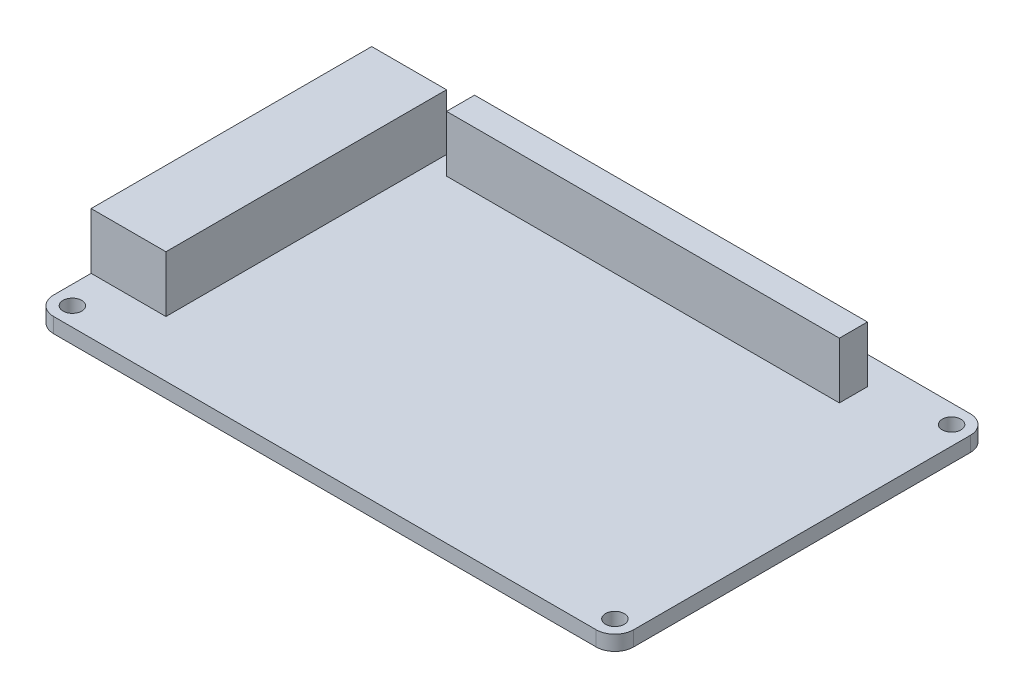
ISO-10303-21;
HEADER;
FILE_DESCRIPTION(('STEP AP214'),'2;1');
FILE_NAME('part.step','',(''),(''),'','','');
FILE_SCHEMA(('AUTOMOTIVE_DESIGN { 1 0 10303 214 1 1 1 1 }'));
ENDSEC;
DATA;
#1=APPLICATION_CONTEXT('core data for automotive mechanical design processes');
#2=APPLICATION_PROTOCOL_DEFINITION('international standard','automotive_design',2000,#1);
#3=PRODUCT_CONTEXT('',#1,'mechanical');
#4=PRODUCT('Part','Part','',(#3));
#5=PRODUCT_RELATED_PRODUCT_CATEGORY('part','',(#4));
#6=PRODUCT_DEFINITION_FORMATION('','',#4);
#7=PRODUCT_DEFINITION_CONTEXT('part definition',#1,'design');
#8=PRODUCT_DEFINITION('design','',#6,#7);
#9=PRODUCT_DEFINITION_SHAPE('','',#8);
#10=(LENGTH_UNIT() NAMED_UNIT(*) SI_UNIT(.MILLI.,.METRE.));
#11=(NAMED_UNIT(*) PLANE_ANGLE_UNIT() SI_UNIT($,.RADIAN.));
#12=(NAMED_UNIT(*) SI_UNIT($,.STERADIAN.) SOLID_ANGLE_UNIT());
#13=UNCERTAINTY_MEASURE_WITH_UNIT(LENGTH_MEASURE(1.E-05),#10,'distance_accuracy_value','');
#14=(GEOMETRIC_REPRESENTATION_CONTEXT(3) GLOBAL_UNCERTAINTY_ASSIGNED_CONTEXT((#13)) GLOBAL_UNIT_ASSIGNED_CONTEXT((#10,
#11,#12)) REPRESENTATION_CONTEXT('',''));
#15=CARTESIAN_POINT('',(0.,0.,0.));
#16=DIRECTION('',(0.,0.,1.));
#17=DIRECTION('',(1.,0.,0.));
#18=AXIS2_PLACEMENT_3D('',#15,#16,#17);
#19=CARTESIAN_POINT('',(46.0375,2.54,-28.575));
#20=DIRECTION('',(0.,-1.,0.));
#21=DIRECTION('',(0.,0.,-1.));
#22=AXIS2_PLACEMENT_3D('',#19,#20,#21);
#23=PLANE('',#22);
#24=DIRECTION('',(-1.,0.,0.));
#25=VECTOR('',#24,1.);
#26=CARTESIAN_POINT('',(-49.2125,2.54,-25.4));
#27=LINE('',#26,#25);
#28=CARTESIAN_POINT('',(-36.5125,2.54,-25.4));
#29=VERTEX_POINT('',#28);
#30=CARTESIAN_POINT('',(-49.2125,2.54,-25.4));
#31=VERTEX_POINT('',#30);
#32=EDGE_CURVE('E221',#29,#31,#27,.T.);
#33=ORIENTED_EDGE('',*,*,#32,.F.);
#34=DIRECTION('',(0.,0.,-1.));
#35=VECTOR('',#34,1.);
#36=CARTESIAN_POINT('',(-36.5125,2.54,-25.4));
#37=LINE('',#36,#35);
#38=CARTESIAN_POINT('',(-36.5125,2.54,22.225));
#39=VERTEX_POINT('',#38);
#40=EDGE_CURVE('E210',#39,#29,#37,.T.);
#41=ORIENTED_EDGE('',*,*,#40,.F.);
#42=DIRECTION('',(1.,0.,0.));
#43=VECTOR('',#42,1.);
#44=CARTESIAN_POINT('',(-49.2125,2.54,22.225));
#45=LINE('',#44,#43);
#46=CARTESIAN_POINT('',(-49.2125,2.54,22.225));
#47=VERTEX_POINT('',#46);
#48=EDGE_CURVE('E205',#47,#39,#45,.T.);
#49=ORIENTED_EDGE('',*,*,#48,.F.);
#50=DIRECTION('',(0.,0.,1.));
#51=VECTOR('',#50,1.);
#52=CARTESIAN_POINT('',(-49.2125,2.54,-28.575));
#53=LINE('',#52,#51);
#54=CARTESIAN_POINT('',(-49.2125,2.54,28.575));
#55=VERTEX_POINT('',#54);
#56=EDGE_CURVE('E290',#47,#55,#53,.T.);
#57=ORIENTED_EDGE('',*,*,#56,.T.);
#58=CARTESIAN_POINT('',(-46.0375,2.54,28.575));
#59=DIRECTION('',(0.,1.,0.));
#60=DIRECTION('',(0.,0.,1.));
#61=AXIS2_PLACEMENT_3D('',#58,#59,#60);
#62=CIRCLE('',#61,3.175);
#63=CARTESIAN_POINT('',(-46.0375,2.54,31.75));
#64=VERTEX_POINT('',#63);
#65=EDGE_CURVE('E294',#55,#64,#62,.T.);
#66=ORIENTED_EDGE('',*,*,#65,.T.);
#67=DIRECTION('',(1.,0.,0.));
#68=VECTOR('',#67,1.);
#69=CARTESIAN_POINT('',(-46.0375,2.54,31.75));
#70=LINE('',#69,#68);
#71=CARTESIAN_POINT('',(46.0375,2.54,31.75));
#72=VERTEX_POINT('',#71);
#73=EDGE_CURVE('E296',#64,#72,#70,.T.);
#74=ORIENTED_EDGE('',*,*,#73,.T.);
#75=CARTESIAN_POINT('',(46.0375,2.54,28.575));
#76=DIRECTION('',(0.,1.,0.));
#77=DIRECTION('',(0.,0.,1.));
#78=AXIS2_PLACEMENT_3D('',#75,#76,#77);
#79=CIRCLE('',#78,3.175);
#80=CARTESIAN_POINT('',(49.2125,2.54,28.575));
#81=VERTEX_POINT('',#80);
#82=EDGE_CURVE('E299',#72,#81,#79,.T.);
#83=ORIENTED_EDGE('',*,*,#82,.T.);
#84=DIRECTION('',(0.,0.,-1.));
#85=VECTOR('',#84,1.);
#86=CARTESIAN_POINT('',(49.2125,2.54,-28.575));
#87=LINE('',#86,#85);
#88=CARTESIAN_POINT('',(49.2125,2.54,-28.575));
#89=VERTEX_POINT('',#88);
#90=EDGE_CURVE('E302',#81,#89,#87,.T.);
#91=ORIENTED_EDGE('',*,*,#90,.T.);
#92=CARTESIAN_POINT('',(46.0375,2.54,-28.575));
#93=DIRECTION('',(0.,1.,0.));
#94=DIRECTION('',(0.,0.,-1.));
#95=AXIS2_PLACEMENT_3D('',#92,#93,#94);
#96=CIRCLE('',#95,3.175);
#97=CARTESIAN_POINT('',(46.0375,2.54,-31.75));
#98=VERTEX_POINT('',#97);
#99=EDGE_CURVE('E279',#89,#98,#96,.T.);
#100=ORIENTED_EDGE('',*,*,#99,.T.);
#101=DIRECTION('',(-1.,0.,0.));
#102=VECTOR('',#101,1.);
#103=CARTESIAN_POINT('',(-46.0375,2.54,-31.75));
#104=LINE('',#103,#102);
#105=CARTESIAN_POINT('',(-46.0375,2.54,-31.75));
#106=VERTEX_POINT('',#105);
#107=EDGE_CURVE('E283',#98,#106,#104,.T.);
#108=ORIENTED_EDGE('',*,*,#107,.T.);
#109=CARTESIAN_POINT('',(-46.0375,2.54,-28.575));
#110=DIRECTION('',(0.,1.,0.));
#111=DIRECTION('',(0.,0.,1.));
#112=AXIS2_PLACEMENT_3D('',#109,#110,#111);
#113=CIRCLE('',#112,3.175);
#114=CARTESIAN_POINT('',(-49.2125,2.54,-28.575));
#115=VERTEX_POINT('',#114);
#116=EDGE_CURVE('E287',#106,#115,#113,.T.);
#117=ORIENTED_EDGE('',*,*,#116,.T.);
#118=EDGE_CURVE('E291',#115,#31,#53,.T.);
#119=ORIENTED_EDGE('',*,*,#118,.T.);
#120=EDGE_LOOP('',(#33,#41,#49,#57,#66,#74,#83,#91,#100,#108,#117,#119));
#121=FACE_BOUND('',#120,.T.);
#122=CARTESIAN_POINT('',(-46.0375,2.54,-28.575));
#123=DIRECTION('',(0.,1.,0.));
#124=DIRECTION('',(0.,0.,1.));
#125=AXIS2_PLACEMENT_3D('',#122,#123,#124);
#126=CIRCLE('',#125,1.5875);
#127=CARTESIAN_POINT('',(-46.0375,2.54,-26.9875));
#128=VERTEX_POINT('',#127);
#129=EDGE_CURVE('E271',#128,#128,#126,.T.);
#130=ORIENTED_EDGE('',*,*,#129,.F.);
#131=EDGE_LOOP('',(#130));
#132=FACE_BOUND('',#131,.T.);
#133=CARTESIAN_POINT('',(46.0375,2.54,-28.575));
#134=DIRECTION('',(0.,1.,0.));
#135=DIRECTION('',(0.,0.,-1.));
#136=AXIS2_PLACEMENT_3D('',#133,#134,#135);
#137=CIRCLE('',#136,1.58750000000001);
#138=CARTESIAN_POINT('',(46.0375,2.54,-30.1625));
#139=VERTEX_POINT('',#138);
#140=EDGE_CURVE('E264',#139,#139,#137,.T.);
#141=ORIENTED_EDGE('',*,*,#140,.F.);
#142=EDGE_LOOP('',(#141));
#143=FACE_BOUND('',#142,.T.);
#144=CARTESIAN_POINT('',(46.0375,2.54,28.575));
#145=DIRECTION('',(0.,1.,0.));
#146=DIRECTION('',(0.,0.,1.));
#147=AXIS2_PLACEMENT_3D('',#144,#145,#146);
#148=CIRCLE('',#147,1.58750000000001);
#149=CARTESIAN_POINT('',(46.0375,2.54,30.1625));
#150=VERTEX_POINT('',#149);
#151=EDGE_CURVE('E256',#150,#150,#148,.T.);
#152=ORIENTED_EDGE('',*,*,#151,.F.);
#153=EDGE_LOOP('',(#152));
#154=FACE_BOUND('',#153,.T.);
#155=CARTESIAN_POINT('',(-46.0375,2.54,28.575));
#156=DIRECTION('',(0.,1.,0.));
#157=DIRECTION('',(0.,0.,-1.));
#158=AXIS2_PLACEMENT_3D('',#155,#156,#157);
#159=CIRCLE('',#158,1.58749999999999);
#160=CARTESIAN_POINT('',(-46.0375,2.54,26.9875));
#161=VERTEX_POINT('',#160);
#162=EDGE_CURVE('E250',#161,#161,#159,.T.);
#163=ORIENTED_EDGE('',*,*,#162,.F.);
#164=EDGE_LOOP('',(#163));
#165=FACE_BOUND('',#164,.T.);
#166=DIRECTION('',(0.,0.,-1.));
#167=VECTOR('',#166,1.);
#168=CARTESIAN_POINT('',(33.3375,2.54,-26.9875));
#169=LINE('',#168,#167);
#170=CARTESIAN_POINT('',(33.3375,2.54,-22.225));
#171=VERTEX_POINT('',#170);
#172=CARTESIAN_POINT('',(33.3375,2.54,-26.9875));
#173=VERTEX_POINT('',#172);
#174=EDGE_CURVE('E203',#171,#173,#169,.T.);
#175=ORIENTED_EDGE('',*,*,#174,.F.);
#176=DIRECTION('',(1.,0.,0.));
#177=VECTOR('',#176,1.);
#178=CARTESIAN_POINT('',(33.3375,2.54,-22.225));
#179=LINE('',#178,#177);
#180=CARTESIAN_POINT('',(-33.3375,2.54,-22.225));
#181=VERTEX_POINT('',#180);
#182=EDGE_CURVE('E200',#181,#171,#179,.T.);
#183=ORIENTED_EDGE('',*,*,#182,.F.);
#184=DIRECTION('',(0.,0.,1.));
#185=VECTOR('',#184,1.);
#186=CARTESIAN_POINT('',(-33.3375,2.54,-26.9875));
#187=LINE('',#186,#185);
#188=CARTESIAN_POINT('',(-33.3375,2.54,-26.9875));
#189=VERTEX_POINT('',#188);
#190=EDGE_CURVE('E74',#189,#181,#187,.T.);
#191=ORIENTED_EDGE('',*,*,#190,.F.);
#192=DIRECTION('',(-1.,0.,0.));
#193=VECTOR('',#192,1.);
#194=CARTESIAN_POINT('',(33.3375,2.54,-26.9875));
#195=LINE('',#194,#193);
#196=EDGE_CURVE('E69',#173,#189,#195,.T.);
#197=ORIENTED_EDGE('',*,*,#196,.F.);
#198=EDGE_LOOP('',(#175,#183,#191,#197));
#199=FACE_BOUND('',#198,.T.);
#200=ADVANCED_FACE('F50',(#121,#132,#143,#154,#165,#199),#23,.F.);
#201=CARTESIAN_POINT('',(46.0375,0.,-28.575));
#202=DIRECTION('',(0.,-1.,0.));
#203=DIRECTION('',(0.,0.,-1.));
#204=AXIS2_PLACEMENT_3D('',#201,#202,#203);
#205=PLANE('',#204);
#206=CARTESIAN_POINT('',(46.0375,0.,28.575));
#207=DIRECTION('',(0.,1.,0.));
#208=DIRECTION('',(0.,0.,1.));
#209=AXIS2_PLACEMENT_3D('',#206,#207,#208);
#210=CIRCLE('',#209,1.58750000000001);
#211=CARTESIAN_POINT('',(46.0375,0.,30.1625));
#212=VERTEX_POINT('',#211);
#213=EDGE_CURVE('E253',#212,#212,#210,.T.);
#214=ORIENTED_EDGE('',*,*,#213,.T.);
#215=EDGE_LOOP('',(#214));
#216=FACE_BOUND('',#215,.T.);
#217=CARTESIAN_POINT('',(-46.0375,0.,-28.575));
#218=DIRECTION('',(0.,1.,0.));
#219=DIRECTION('',(0.,0.,1.));
#220=AXIS2_PLACEMENT_3D('',#217,#218,#219);
#221=CIRCLE('',#220,1.5875);
#222=CARTESIAN_POINT('',(-46.0375,0.,-26.9875));
#223=VERTEX_POINT('',#222);
#224=EDGE_CURVE('E268',#223,#223,#221,.T.);
#225=ORIENTED_EDGE('',*,*,#224,.T.);
#226=EDGE_LOOP('',(#225));
#227=FACE_BOUND('',#226,.T.);
#228=CARTESIAN_POINT('',(46.0375,0.,-28.575));
#229=DIRECTION('',(0.,1.,0.));
#230=DIRECTION('',(0.,0.,-1.));
#231=AXIS2_PLACEMENT_3D('',#228,#229,#230);
#232=CIRCLE('',#231,3.175);
#233=CARTESIAN_POINT('',(49.2125,0.,-28.575));
#234=VERTEX_POINT('',#233);
#235=CARTESIAN_POINT('',(46.0375,0.,-31.75));
#236=VERTEX_POINT('',#235);
#237=EDGE_CURVE('E275',#234,#236,#232,.T.);
#238=ORIENTED_EDGE('',*,*,#237,.F.);
#239=DIRECTION('',(0.,0.,-1.));
#240=VECTOR('',#239,1.);
#241=CARTESIAN_POINT('',(49.2125,0.,-28.575));
#242=LINE('',#241,#240);
#243=CARTESIAN_POINT('',(49.2125,0.,28.575));
#244=VERTEX_POINT('',#243);
#245=EDGE_CURVE('E284',#244,#234,#242,.T.);
#246=ORIENTED_EDGE('',*,*,#245,.F.);
#247=CARTESIAN_POINT('',(46.0375,0.,28.575));
#248=DIRECTION('',(0.,1.,0.));
#249=DIRECTION('',(0.,0.,1.));
#250=AXIS2_PLACEMENT_3D('',#247,#248,#249);
#251=CIRCLE('',#250,3.175);
#252=CARTESIAN_POINT('',(46.0375,0.,31.75));
#253=VERTEX_POINT('',#252);
#254=EDGE_CURVE('E322',#253,#244,#251,.T.);
#255=ORIENTED_EDGE('',*,*,#254,.F.);
#256=DIRECTION('',(1.,0.,0.));
#257=VECTOR('',#256,1.);
#258=CARTESIAN_POINT('',(-46.0375,0.,31.75));
#259=LINE('',#258,#257);
#260=CARTESIAN_POINT('',(-46.0375,0.,31.75));
#261=VERTEX_POINT('',#260);
#262=EDGE_CURVE('E319',#261,#253,#259,.T.);
#263=ORIENTED_EDGE('',*,*,#262,.F.);
#264=CARTESIAN_POINT('',(-46.0375,0.,28.575));
#265=DIRECTION('',(0.,1.,0.));
#266=DIRECTION('',(0.,0.,1.));
#267=AXIS2_PLACEMENT_3D('',#264,#265,#266);
#268=CIRCLE('',#267,3.175);
#269=CARTESIAN_POINT('',(-49.2125,0.,28.575));
#270=VERTEX_POINT('',#269);
#271=EDGE_CURVE('E317',#270,#261,#268,.T.);
#272=ORIENTED_EDGE('',*,*,#271,.F.);
#273=DIRECTION('',(0.,0.,1.));
#274=VECTOR('',#273,1.);
#275=CARTESIAN_POINT('',(-49.2125,0.,-28.575));
#276=LINE('',#275,#274);
#277=CARTESIAN_POINT('',(-49.2125,0.,-28.575));
#278=VERTEX_POINT('',#277);
#279=EDGE_CURVE('E314',#278,#270,#276,.T.);
#280=ORIENTED_EDGE('',*,*,#279,.F.);
#281=CARTESIAN_POINT('',(-46.0375,0.,-28.575));
#282=DIRECTION('',(0.,1.,0.));
#283=DIRECTION('',(0.,0.,1.));
#284=AXIS2_PLACEMENT_3D('',#281,#282,#283);
#285=CIRCLE('',#284,3.175);
#286=CARTESIAN_POINT('',(-46.0375,0.,-31.75));
#287=VERTEX_POINT('',#286);
#288=EDGE_CURVE('E311',#287,#278,#285,.T.);
#289=ORIENTED_EDGE('',*,*,#288,.F.);
#290=DIRECTION('',(-1.,0.,0.));
#291=VECTOR('',#290,1.);
#292=CARTESIAN_POINT('',(-46.0375,0.,-31.75));
#293=LINE('',#292,#291);
#294=EDGE_CURVE('E308',#236,#287,#293,.T.);
#295=ORIENTED_EDGE('',*,*,#294,.F.);
#296=EDGE_LOOP('',(#238,#246,#255,#263,#272,#280,#289,#295));
#297=FACE_BOUND('',#296,.T.);
#298=CARTESIAN_POINT('',(46.0375,0.,-28.575));
#299=DIRECTION('',(0.,1.,0.));
#300=DIRECTION('',(0.,0.,-1.));
#301=AXIS2_PLACEMENT_3D('',#298,#299,#300);
#302=CIRCLE('',#301,1.58750000000001);
#303=CARTESIAN_POINT('',(46.0375,0.,-30.1625));
#304=VERTEX_POINT('',#303);
#305=EDGE_CURVE('E260',#304,#304,#302,.T.);
#306=ORIENTED_EDGE('',*,*,#305,.T.);
#307=EDGE_LOOP('',(#306));
#308=FACE_BOUND('',#307,.T.);
#309=CARTESIAN_POINT('',(-46.0375,0.,28.575));
#310=DIRECTION('',(0.,1.,0.));
#311=DIRECTION('',(0.,0.,-1.));
#312=AXIS2_PLACEMENT_3D('',#309,#310,#311);
#313=CIRCLE('',#312,1.58749999999999);
#314=CARTESIAN_POINT('',(-46.0375,0.,26.9875));
#315=VERTEX_POINT('',#314);
#316=EDGE_CURVE('E249',#315,#315,#313,.T.);
#317=ORIENTED_EDGE('',*,*,#316,.T.);
#318=EDGE_LOOP('',(#317));
#319=FACE_BOUND('',#318,.T.);
#320=ADVANCED_FACE('F359',(#216,#227,#297,#308,#319),#205,.T.);
#321=CARTESIAN_POINT('',(46.0375,2.54,-28.575));
#322=DIRECTION('',(0.,-1.,0.));
#323=DIRECTION('',(0.,0.,-1.));
#324=AXIS2_PLACEMENT_3D('',#321,#322,#323);
#325=CYLINDRICAL_SURFACE('',#324,3.175);
#326=ORIENTED_EDGE('',*,*,#237,.T.);
#327=DIRECTION('',(0.,-1.,0.));
#328=VECTOR('',#327,1.);
#329=CARTESIAN_POINT('',(46.0375,2.54,-31.75));
#330=LINE('',#329,#328);
#331=EDGE_CURVE('E13',#98,#236,#330,.T.);
#332=ORIENTED_EDGE('',*,*,#331,.F.);
#333=ORIENTED_EDGE('',*,*,#99,.F.);
#334=DIRECTION('',(0.,-1.,0.));
#335=VECTOR('',#334,1.);
#336=CARTESIAN_POINT('',(49.2125,2.54,-28.575));
#337=LINE('',#336,#335);
#338=EDGE_CURVE('E305',#89,#234,#337,.T.);
#339=ORIENTED_EDGE('',*,*,#338,.T.);
#340=EDGE_LOOP('',(#326,#332,#333,#339));
#341=FACE_BOUND('',#340,.T.);
#342=ADVANCED_FACE('F52',(#341),#325,.T.);
#343=CARTESIAN_POINT('',(-46.0375,2.54,-31.75));
#344=DIRECTION('',(0.,0.,1.));
#345=DIRECTION('',(1.,0.,0.));
#346=AXIS2_PLACEMENT_3D('',#343,#344,#345);
#347=PLANE('',#346);
#348=ORIENTED_EDGE('',*,*,#294,.T.);
#349=DIRECTION('',(0.,-1.,0.));
#350=VECTOR('',#349,1.);
#351=CARTESIAN_POINT('',(-46.0375,2.54,-31.75));
#352=LINE('',#351,#350);
#353=EDGE_CURVE('E59',#106,#287,#352,.T.);
#354=ORIENTED_EDGE('',*,*,#353,.F.);
#355=ORIENTED_EDGE('',*,*,#107,.F.);
#356=ORIENTED_EDGE('',*,*,#331,.T.);
#357=EDGE_LOOP('',(#348,#354,#355,#356));
#358=FACE_BOUND('',#357,.T.);
#359=ADVANCED_FACE('F428',(#358),#347,.F.);
#360=CARTESIAN_POINT('',(-46.0375,2.54,-28.575));
#361=DIRECTION('',(0.,-1.,0.));
#362=DIRECTION('',(0.,0.,-1.));
#363=AXIS2_PLACEMENT_3D('',#360,#361,#362);
#364=CYLINDRICAL_SURFACE('',#363,3.175);
#365=ORIENTED_EDGE('',*,*,#288,.T.);
#366=DIRECTION('',(0.,-1.,0.));
#367=VECTOR('',#366,1.);
#368=CARTESIAN_POINT('',(-49.2125,2.54,-28.575));
#369=LINE('',#368,#367);
#370=EDGE_CURVE('E344',#115,#278,#369,.T.);
#371=ORIENTED_EDGE('',*,*,#370,.F.);
#372=ORIENTED_EDGE('',*,*,#116,.F.);
#373=ORIENTED_EDGE('',*,*,#353,.T.);
#374=EDGE_LOOP('',(#365,#371,#372,#373));
#375=FACE_BOUND('',#374,.T.);
#376=ADVANCED_FACE('F353',(#375),#364,.T.);
#377=CARTESIAN_POINT('',(-49.2125,2.54,-28.575));
#378=DIRECTION('',(1.,0.,0.));
#379=DIRECTION('',(0.,0.,-1.));
#380=AXIS2_PLACEMENT_3D('',#377,#378,#379);
#381=PLANE('',#380);
#382=ORIENTED_EDGE('',*,*,#279,.T.);
#383=DIRECTION('',(0.,-1.,0.));
#384=VECTOR('',#383,1.);
#385=CARTESIAN_POINT('',(-49.2125,2.54,28.575));
#386=LINE('',#385,#384);
#387=EDGE_CURVE('E341',#55,#270,#386,.T.);
#388=ORIENTED_EDGE('',*,*,#387,.F.);
#389=ORIENTED_EDGE('',*,*,#56,.F.);
#390=DIRECTION('',(0.,-1.,0.));
#391=VECTOR('',#390,1.);
#392=CARTESIAN_POINT('',(-49.2125,12.065,22.225));
#393=LINE('',#392,#391);
#394=CARTESIAN_POINT('',(-49.2125,12.065,22.225));
#395=VERTEX_POINT('',#394);
#396=EDGE_CURVE('E246',#395,#47,#393,.T.);
#397=ORIENTED_EDGE('',*,*,#396,.F.);
#398=DIRECTION('',(0.,0.,1.));
#399=VECTOR('',#398,1.);
#400=CARTESIAN_POINT('',(-49.2125,12.065,-25.4));
#401=LINE('',#400,#399);
#402=CARTESIAN_POINT('',(-49.2125,12.065,-25.4));
#403=VERTEX_POINT('',#402);
#404=EDGE_CURVE('E216',#403,#395,#401,.T.);
#405=ORIENTED_EDGE('',*,*,#404,.F.);
#406=DIRECTION('',(0.,-1.,0.));
#407=VECTOR('',#406,1.);
#408=CARTESIAN_POINT('',(-49.2125,12.065,-25.4));
#409=LINE('',#408,#407);
#410=EDGE_CURVE('E229',#403,#31,#409,.T.);
#411=ORIENTED_EDGE('',*,*,#410,.T.);
#412=ORIENTED_EDGE('',*,*,#118,.F.);
#413=ORIENTED_EDGE('',*,*,#370,.T.);
#414=EDGE_LOOP('',(#382,#388,#389,#397,#405,#411,#412,#413));
#415=FACE_BOUND('',#414,.T.);
#416=ADVANCED_FACE('F365',(#415),#381,.F.);
#417=CARTESIAN_POINT('',(-46.0375,2.54,28.575));
#418=DIRECTION('',(0.,-1.,0.));
#419=DIRECTION('',(0.,0.,-1.));
#420=AXIS2_PLACEMENT_3D('',#417,#418,#419);
#421=CYLINDRICAL_SURFACE('',#420,3.175);
#422=ORIENTED_EDGE('',*,*,#271,.T.);
#423=DIRECTION('',(0.,-1.,0.));
#424=VECTOR('',#423,1.);
#425=CARTESIAN_POINT('',(-46.0375,2.54,31.75));
#426=LINE('',#425,#424);
#427=EDGE_CURVE('E338',#64,#261,#426,.T.);
#428=ORIENTED_EDGE('',*,*,#427,.F.);
#429=ORIENTED_EDGE('',*,*,#65,.F.);
#430=ORIENTED_EDGE('',*,*,#387,.T.);
#431=EDGE_LOOP('',(#422,#428,#429,#430));
#432=FACE_BOUND('',#431,.T.);
#433=ADVANCED_FACE('F370',(#432),#421,.T.);
#434=CARTESIAN_POINT('',(-46.0375,2.54,31.75));
#435=DIRECTION('',(0.,0.,-1.));
#436=DIRECTION('',(-1.,0.,0.));
#437=AXIS2_PLACEMENT_3D('',#434,#435,#436);
#438=PLANE('',#437);
#439=ORIENTED_EDGE('',*,*,#262,.T.);
#440=DIRECTION('',(0.,-1.,0.));
#441=VECTOR('',#440,1.);
#442=CARTESIAN_POINT('',(46.0375,2.54,31.75));
#443=LINE('',#442,#441);
#444=EDGE_CURVE('E334',#72,#253,#443,.T.);
#445=ORIENTED_EDGE('',*,*,#444,.F.);
#446=ORIENTED_EDGE('',*,*,#73,.F.);
#447=ORIENTED_EDGE('',*,*,#427,.T.);
#448=EDGE_LOOP('',(#439,#445,#446,#447));
#449=FACE_BOUND('',#448,.T.);
#450=ADVANCED_FACE('F418',(#449),#438,.F.);
#451=CARTESIAN_POINT('',(46.0375,2.54,28.575));
#452=DIRECTION('',(0.,-1.,0.));
#453=DIRECTION('',(0.,0.,-1.));
#454=AXIS2_PLACEMENT_3D('',#451,#452,#453);
#455=CYLINDRICAL_SURFACE('',#454,3.175);
#456=ORIENTED_EDGE('',*,*,#254,.T.);
#457=DIRECTION('',(0.,-1.,0.));
#458=VECTOR('',#457,1.);
#459=CARTESIAN_POINT('',(49.2125,2.54,28.575));
#460=LINE('',#459,#458);
#461=EDGE_CURVE('E330',#81,#244,#460,.T.);
#462=ORIENTED_EDGE('',*,*,#461,.F.);
#463=ORIENTED_EDGE('',*,*,#82,.F.);
#464=ORIENTED_EDGE('',*,*,#444,.T.);
#465=EDGE_LOOP('',(#456,#462,#463,#464));
#466=FACE_BOUND('',#465,.T.);
#467=ADVANCED_FACE('F414',(#466),#455,.T.);
#468=CARTESIAN_POINT('',(49.2125,2.54,-28.575));
#469=DIRECTION('',(-1.,0.,0.));
#470=DIRECTION('',(0.,0.,1.));
#471=AXIS2_PLACEMENT_3D('',#468,#469,#470);
#472=PLANE('',#471);
#473=ORIENTED_EDGE('',*,*,#245,.T.);
#474=ORIENTED_EDGE('',*,*,#338,.F.);
#475=ORIENTED_EDGE('',*,*,#90,.F.);
#476=ORIENTED_EDGE('',*,*,#461,.T.);
#477=EDGE_LOOP('',(#473,#474,#475,#476));
#478=FACE_BOUND('',#477,.T.);
#479=ADVANCED_FACE('F411',(#478),#472,.F.);
#480=CARTESIAN_POINT('',(-46.0375,2.54,-28.575));
#481=DIRECTION('',(0.,-1.,0.));
#482=DIRECTION('',(0.,0.,-1.));
#483=AXIS2_PLACEMENT_3D('',#480,#481,#482);
#484=CYLINDRICAL_SURFACE('',#483,1.5875);
#485=ORIENTED_EDGE('',*,*,#129,.T.);
#486=EDGE_LOOP('',(#485));
#487=FACE_BOUND('',#486,.T.);
#488=ORIENTED_EDGE('',*,*,#224,.F.);
#489=EDGE_LOOP('',(#488));
#490=FACE_BOUND('',#489,.T.);
#491=ADVANCED_FACE('F408',(#487,#490),#484,.F.);
#492=CARTESIAN_POINT('',(46.0375,2.54,-28.575));
#493=DIRECTION('',(0.,-1.,0.));
#494=DIRECTION('',(0.,0.,-1.));
#495=AXIS2_PLACEMENT_3D('',#492,#493,#494);
#496=CYLINDRICAL_SURFACE('',#495,1.58750000000001);
#497=ORIENTED_EDGE('',*,*,#140,.T.);
#498=EDGE_LOOP('',(#497));
#499=FACE_BOUND('',#498,.T.);
#500=ORIENTED_EDGE('',*,*,#305,.F.);
#501=EDGE_LOOP('',(#500));
#502=FACE_BOUND('',#501,.T.);
#503=ADVANCED_FACE('F465',(#499,#502),#496,.F.);
#504=CARTESIAN_POINT('',(46.0375,2.54,28.575));
#505=DIRECTION('',(0.,-1.,0.));
#506=DIRECTION('',(0.,0.,-1.));
#507=AXIS2_PLACEMENT_3D('',#504,#505,#506);
#508=CYLINDRICAL_SURFACE('',#507,1.58750000000001);
#509=ORIENTED_EDGE('',*,*,#151,.T.);
#510=EDGE_LOOP('',(#509));
#511=FACE_BOUND('',#510,.T.);
#512=ORIENTED_EDGE('',*,*,#213,.F.);
#513=EDGE_LOOP('',(#512));
#514=FACE_BOUND('',#513,.T.);
#515=ADVANCED_FACE('F529',(#511,#514),#508,.F.);
#516=CARTESIAN_POINT('',(-46.0375,2.54,28.575));
#517=DIRECTION('',(0.,-1.,0.));
#518=DIRECTION('',(0.,0.,-1.));
#519=AXIS2_PLACEMENT_3D('',#516,#517,#518);
#520=CYLINDRICAL_SURFACE('',#519,1.58749999999999);
#521=ORIENTED_EDGE('',*,*,#162,.T.);
#522=EDGE_LOOP('',(#521));
#523=FACE_BOUND('',#522,.T.);
#524=ORIENTED_EDGE('',*,*,#316,.F.);
#525=EDGE_LOOP('',(#524));
#526=FACE_BOUND('',#525,.T.);
#527=ADVANCED_FACE('F398',(#523,#526),#520,.F.);
#528=CARTESIAN_POINT('',(-49.2125,12.065,22.225));
#529=DIRECTION('',(0.,0.,-1.));
#530=DIRECTION('',(-1.,0.,0.));
#531=AXIS2_PLACEMENT_3D('',#528,#529,#530);
#532=PLANE('',#531);
#533=ORIENTED_EDGE('',*,*,#48,.T.);
#534=DIRECTION('',(0.,-1.,0.));
#535=VECTOR('',#534,1.);
#536=CARTESIAN_POINT('',(-36.5125,12.065,22.225));
#537=LINE('',#536,#535);
#538=CARTESIAN_POINT('',(-36.5125,12.065,22.225));
#539=VERTEX_POINT('',#538);
#540=EDGE_CURVE('E242',#539,#39,#537,.T.);
#541=ORIENTED_EDGE('',*,*,#540,.F.);
#542=DIRECTION('',(1.,0.,0.));
#543=VECTOR('',#542,1.);
#544=CARTESIAN_POINT('',(-49.2125,12.065,22.225));
#545=LINE('',#544,#543);
#546=EDGE_CURVE('E220',#395,#539,#545,.T.);
#547=ORIENTED_EDGE('',*,*,#546,.F.);
#548=ORIENTED_EDGE('',*,*,#396,.T.);
#549=EDGE_LOOP('',(#533,#541,#547,#548));
#550=FACE_BOUND('',#549,.T.);
#551=ADVANCED_FACE('F379',(#550),#532,.F.);
#552=CARTESIAN_POINT('',(-36.5125,12.065,-25.4));
#553=DIRECTION('',(-1.,0.,0.));
#554=DIRECTION('',(0.,0.,1.));
#555=AXIS2_PLACEMENT_3D('',#552,#553,#554);
#556=PLANE('',#555);
#557=ORIENTED_EDGE('',*,*,#40,.T.);
#558=DIRECTION('',(0.,-1.,0.));
#559=VECTOR('',#558,1.);
#560=CARTESIAN_POINT('',(-36.5125,12.065,-25.4));
#561=LINE('',#560,#559);
#562=CARTESIAN_POINT('',(-36.5125,12.065,-25.4));
#563=VERTEX_POINT('',#562);
#564=EDGE_CURVE('E239',#563,#29,#561,.T.);
#565=ORIENTED_EDGE('',*,*,#564,.F.);
#566=DIRECTION('',(0.,0.,-1.));
#567=VECTOR('',#566,1.);
#568=CARTESIAN_POINT('',(-36.5125,12.065,-25.4));
#569=LINE('',#568,#567);
#570=EDGE_CURVE('E224',#539,#563,#569,.T.);
#571=ORIENTED_EDGE('',*,*,#570,.F.);
#572=ORIENTED_EDGE('',*,*,#540,.T.);
#573=EDGE_LOOP('',(#557,#565,#571,#572));
#574=FACE_BOUND('',#573,.T.);
#575=ADVANCED_FACE('F390',(#574),#556,.F.);
#576=CARTESIAN_POINT('',(-49.2125,12.065,-25.4));
#577=DIRECTION('',(0.,0.,1.));
#578=DIRECTION('',(1.,0.,0.));
#579=AXIS2_PLACEMENT_3D('',#576,#577,#578);
#580=PLANE('',#579);
#581=ORIENTED_EDGE('',*,*,#32,.T.);
#582=ORIENTED_EDGE('',*,*,#410,.F.);
#583=DIRECTION('',(-1.,0.,0.));
#584=VECTOR('',#583,1.);
#585=CARTESIAN_POINT('',(-49.2125,12.065,-25.4));
#586=LINE('',#585,#584);
#587=EDGE_CURVE('E227',#563,#403,#586,.T.);
#588=ORIENTED_EDGE('',*,*,#587,.F.);
#589=ORIENTED_EDGE('',*,*,#564,.T.);
#590=EDGE_LOOP('',(#581,#582,#588,#589));
#591=FACE_BOUND('',#590,.T.);
#592=ADVANCED_FACE('F387',(#591),#580,.F.);
#593=CARTESIAN_POINT('',(0.,12.065,0.));
#594=DIRECTION('',(0.,1.,0.));
#595=DIRECTION('',(0.,0.,1.));
#596=AXIS2_PLACEMENT_3D('',#593,#594,#595);
#597=PLANE('',#596);
#598=ORIENTED_EDGE('',*,*,#404,.T.);
#599=ORIENTED_EDGE('',*,*,#546,.T.);
#600=ORIENTED_EDGE('',*,*,#570,.T.);
#601=ORIENTED_EDGE('',*,*,#587,.T.);
#602=EDGE_LOOP('',(#598,#599,#600,#601));
#603=FACE_BOUND('',#602,.T.);
#604=ADVANCED_FACE('F383',(#603),#597,.T.);
#605=CARTESIAN_POINT('',(33.3375,12.065,-26.9875));
#606=DIRECTION('',(-1.,0.,0.));
#607=DIRECTION('',(0.,0.,1.));
#608=AXIS2_PLACEMENT_3D('',#605,#606,#607);
#609=PLANE('',#608);
#610=ORIENTED_EDGE('',*,*,#174,.T.);
#611=DIRECTION('',(0.,-1.,0.));
#612=VECTOR('',#611,1.);
#613=CARTESIAN_POINT('',(33.3375,12.065,-26.9875));
#614=LINE('',#613,#612);
#615=CARTESIAN_POINT('',(33.3375,12.065,-26.9875));
#616=VERTEX_POINT('',#615);
#617=EDGE_CURVE('E182',#616,#173,#614,.T.);
#618=ORIENTED_EDGE('',*,*,#617,.F.);
#619=DIRECTION('',(0.,0.,-1.));
#620=VECTOR('',#619,1.);
#621=CARTESIAN_POINT('',(33.3375,12.065,-26.9875));
#622=LINE('',#621,#620);
#623=CARTESIAN_POINT('',(33.3375,12.065,-22.225));
#624=VERTEX_POINT('',#623);
#625=EDGE_CURVE('E190',#624,#616,#622,.T.);
#626=ORIENTED_EDGE('',*,*,#625,.F.);
#627=DIRECTION('',(0.,-1.,0.));
#628=VECTOR('',#627,1.);
#629=CARTESIAN_POINT('',(33.3375,12.065,-22.225));
#630=LINE('',#629,#628);
#631=EDGE_CURVE('E611',#624,#171,#630,.T.);
#632=ORIENTED_EDGE('',*,*,#631,.T.);
#633=EDGE_LOOP('',(#610,#618,#626,#632));
#634=FACE_BOUND('',#633,.T.);
#635=ADVANCED_FACE('F202',(#634),#609,.F.);
#636=CARTESIAN_POINT('',(33.3375,12.065,-26.9875));
#637=DIRECTION('',(0.,0.,1.));
#638=DIRECTION('',(1.,0.,0.));
#639=AXIS2_PLACEMENT_3D('',#636,#637,#638);
#640=PLANE('',#639);
#641=ORIENTED_EDGE('',*,*,#196,.T.);
#642=DIRECTION('',(0.,-1.,0.));
#643=VECTOR('',#642,1.);
#644=CARTESIAN_POINT('',(-33.3375,12.065,-26.9875));
#645=LINE('',#644,#643);
#646=CARTESIAN_POINT('',(-33.3375,12.065,-26.9875));
#647=VERTEX_POINT('',#646);
#648=EDGE_CURVE('E185',#647,#189,#645,.T.);
#649=ORIENTED_EDGE('',*,*,#648,.F.);
#650=DIRECTION('',(-1.,0.,0.));
#651=VECTOR('',#650,1.);
#652=CARTESIAN_POINT('',(33.3375,12.065,-26.9875));
#653=LINE('',#652,#651);
#654=EDGE_CURVE('E178',#616,#647,#653,.T.);
#655=ORIENTED_EDGE('',*,*,#654,.F.);
#656=ORIENTED_EDGE('',*,*,#617,.T.);
#657=EDGE_LOOP('',(#641,#649,#655,#656));
#658=FACE_BOUND('',#657,.T.);
#659=ADVANCED_FACE('F180',(#658),#640,.F.);
#660=CARTESIAN_POINT('',(-33.3375,12.065,-26.9875));
#661=DIRECTION('',(1.,0.,0.));
#662=DIRECTION('',(0.,0.,-1.));
#663=AXIS2_PLACEMENT_3D('',#660,#661,#662);
#664=PLANE('',#663);
#665=ORIENTED_EDGE('',*,*,#190,.T.);
#666=DIRECTION('',(0.,-1.,0.));
#667=VECTOR('',#666,1.);
#668=CARTESIAN_POINT('',(-33.3375,12.065,-22.225));
#669=LINE('',#668,#667);
#670=CARTESIAN_POINT('',(-33.3375,12.065,-22.225));
#671=VERTEX_POINT('',#670);
#672=EDGE_CURVE('E212',#671,#181,#669,.T.);
#673=ORIENTED_EDGE('',*,*,#672,.F.);
#674=DIRECTION('',(0.,0.,1.));
#675=VECTOR('',#674,1.);
#676=CARTESIAN_POINT('',(-33.3375,12.065,-26.9875));
#677=LINE('',#676,#675);
#678=EDGE_CURVE('E189',#647,#671,#677,.T.);
#679=ORIENTED_EDGE('',*,*,#678,.F.);
#680=ORIENTED_EDGE('',*,*,#648,.T.);
#681=EDGE_LOOP('',(#665,#673,#679,#680));
#682=FACE_BOUND('',#681,.T.);
#683=ADVANCED_FACE('F578',(#682),#664,.F.);
#684=CARTESIAN_POINT('',(33.3375,12.065,-22.225));
#685=DIRECTION('',(0.,0.,-1.));
#686=DIRECTION('',(-1.,0.,0.));
#687=AXIS2_PLACEMENT_3D('',#684,#685,#686);
#688=PLANE('',#687);
#689=ORIENTED_EDGE('',*,*,#182,.T.);
#690=ORIENTED_EDGE('',*,*,#631,.F.);
#691=DIRECTION('',(1.,0.,0.));
#692=VECTOR('',#691,1.);
#693=CARTESIAN_POINT('',(33.3375,12.065,-22.225));
#694=LINE('',#693,#692);
#695=EDGE_CURVE('E195',#671,#624,#694,.T.);
#696=ORIENTED_EDGE('',*,*,#695,.F.);
#697=ORIENTED_EDGE('',*,*,#672,.T.);
#698=EDGE_LOOP('',(#689,#690,#696,#697));
#699=FACE_BOUND('',#698,.T.);
#700=ADVANCED_FACE('F586',(#699),#688,.F.);
#701=CARTESIAN_POINT('',(0.,12.065,0.));
#702=DIRECTION('',(0.,-1.,0.));
#703=DIRECTION('',(0.,0.,-1.));
#704=AXIS2_PLACEMENT_3D('',#701,#702,#703);
#705=PLANE('',#704);
#706=ORIENTED_EDGE('',*,*,#625,.T.);
#707=ORIENTED_EDGE('',*,*,#654,.T.);
#708=ORIENTED_EDGE('',*,*,#678,.T.);
#709=ORIENTED_EDGE('',*,*,#695,.T.);
#710=EDGE_LOOP('',(#706,#707,#708,#709));
#711=FACE_BOUND('',#710,.T.);
#712=ADVANCED_FACE('F193',(#711),#705,.F.);
#713=CLOSED_SHELL('',(#200,#320,#342,#359,#376,#416,#433,#450,#467,#479,#491,#503,#515,#527,
#551,#575,#592,#604,#635,#659,#683,#700,#712));
#714=MANIFOLD_SOLID_BREP('B2',#713);
#715=ADVANCED_BREP_SHAPE_REPRESENTATION('',(#18,#714),#14);
#716=SHAPE_DEFINITION_REPRESENTATION(#9,#715);
ENDSEC;
END-ISO-10303-21;
